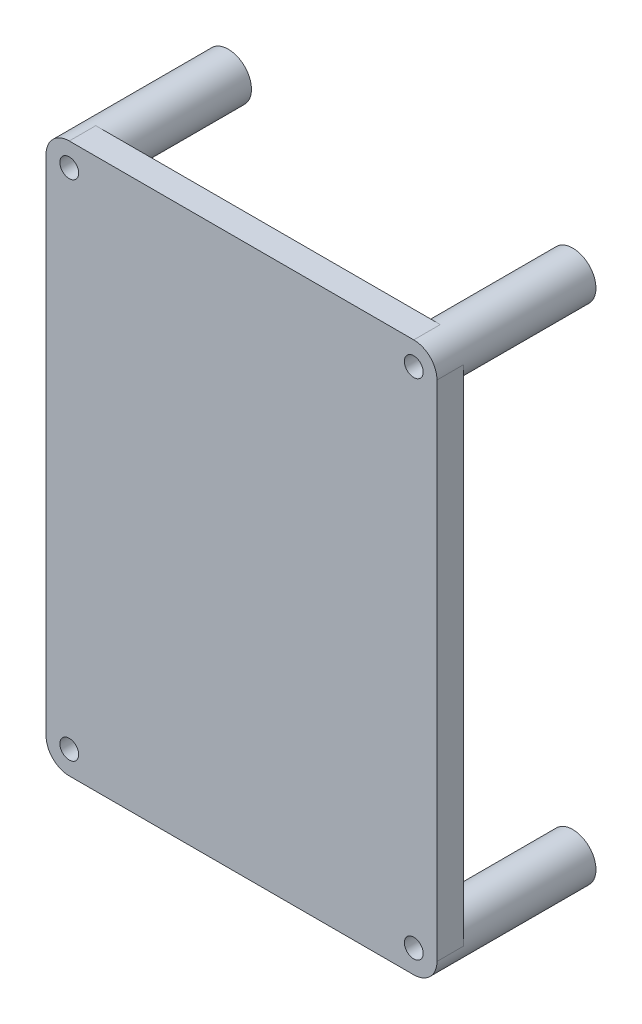
ISO-10303-21;
HEADER;
FILE_DESCRIPTION(('STEP AP214'),'2;1');
FILE_NAME('part.step','',(''),(''),'','','');
FILE_SCHEMA(('AUTOMOTIVE_DESIGN { 1 0 10303 214 1 1 1 1 }'));
ENDSEC;
DATA;
#1=APPLICATION_CONTEXT('core data for automotive mechanical design processes');
#2=APPLICATION_PROTOCOL_DEFINITION('international standard','automotive_design',2000,#1);
#3=PRODUCT_CONTEXT('',#1,'mechanical');
#4=PRODUCT('Part','Part','',(#3));
#5=PRODUCT_RELATED_PRODUCT_CATEGORY('part','',(#4));
#6=PRODUCT_DEFINITION_FORMATION('','',#4);
#7=PRODUCT_DEFINITION_CONTEXT('part definition',#1,'design');
#8=PRODUCT_DEFINITION('design','',#6,#7);
#9=PRODUCT_DEFINITION_SHAPE('','',#8);
#10=(LENGTH_UNIT() NAMED_UNIT(*) SI_UNIT(.MILLI.,.METRE.));
#11=(NAMED_UNIT(*) PLANE_ANGLE_UNIT() SI_UNIT($,.RADIAN.));
#12=(NAMED_UNIT(*) SI_UNIT($,.STERADIAN.) SOLID_ANGLE_UNIT());
#13=UNCERTAINTY_MEASURE_WITH_UNIT(LENGTH_MEASURE(1.E-05),#10,'distance_accuracy_value','');
#14=(GEOMETRIC_REPRESENTATION_CONTEXT(3) GLOBAL_UNCERTAINTY_ASSIGNED_CONTEXT((#13)) GLOBAL_UNIT_ASSIGNED_CONTEXT((#10,
#11,#12)) REPRESENTATION_CONTEXT('',''));
#15=CARTESIAN_POINT('',(0.,0.,0.));
#16=DIRECTION('',(0.,0.,1.));
#17=DIRECTION('',(1.,0.,0.));
#18=AXIS2_PLACEMENT_3D('',#15,#16,#17);
#19=CARTESIAN_POINT('',(160.526557276723,113.230165260636,206.266714262562));
#20=DIRECTION('',(0.,0.,1.));
#21=DIRECTION('',(1.,0.,0.));
#22=AXIS2_PLACEMENT_3D('',#19,#20,#21);
#23=PLANE('',#22);
#24=CARTESIAN_POINT('',(108.526557276723,113.230165260636,206.266714262562));
#25=DIRECTION('',(0.,0.,-1.));
#26=DIRECTION('',(-1.,0.,0.));
#27=AXIS2_PLACEMENT_3D('',#24,#25,#26);
#28=CIRCLE('',#27,3.50000000000001);
#29=CARTESIAN_POINT('',(105.026557276723,113.230165260636,206.266714262562));
#30=VERTEX_POINT('',#29);
#31=CARTESIAN_POINT('',(108.526557276723,109.730165260636,206.266714262562));
#32=VERTEX_POINT('',#31);
#33=EDGE_CURVE('E75',#30,#32,#28,.T.);
#34=ORIENTED_EDGE('',*,*,#33,.F.);
#35=DIRECTION('',(0.,-1.,0.));
#36=VECTOR('',#35,1.);
#37=CARTESIAN_POINT('',(105.026557276723,189.230165260636,206.266714262562));
#38=LINE('',#37,#36);
#39=CARTESIAN_POINT('',(105.026557276723,189.230165260636,206.266714262562));
#40=VERTEX_POINT('',#39);
#41=EDGE_CURVE('E115',#40,#30,#38,.T.);
#42=ORIENTED_EDGE('',*,*,#41,.F.);
#43=CARTESIAN_POINT('',(108.526557276723,189.230165260636,206.266714262562));
#44=DIRECTION('',(0.,0.,-1.));
#45=DIRECTION('',(-1.,0.,0.));
#46=AXIS2_PLACEMENT_3D('',#43,#44,#45);
#47=CIRCLE('',#46,3.50000000000002);
#48=CARTESIAN_POINT('',(108.526557276723,192.730165260636,206.266714262562));
#49=VERTEX_POINT('',#48);
#50=EDGE_CURVE('E11',#49,#40,#47,.T.);
#51=ORIENTED_EDGE('',*,*,#50,.F.);
#52=DIRECTION('',(-1.,0.,0.));
#53=VECTOR('',#52,1.);
#54=CARTESIAN_POINT('',(160.526557276723,192.730165260636,206.266714262562));
#55=LINE('',#54,#53);
#56=CARTESIAN_POINT('',(160.526557276723,192.730165260636,206.266714262562));
#57=VERTEX_POINT('',#56);
#58=EDGE_CURVE('E129',#57,#49,#55,.T.);
#59=ORIENTED_EDGE('',*,*,#58,.F.);
#60=CARTESIAN_POINT('',(160.526557276723,189.230165260636,206.266714262562));
#61=DIRECTION('',(0.,0.,-1.));
#62=DIRECTION('',(-1.,0.,0.));
#63=AXIS2_PLACEMENT_3D('',#60,#61,#62);
#64=CIRCLE('',#63,3.49999999999999);
#65=CARTESIAN_POINT('',(164.026557276723,189.230165260636,206.266714262562));
#66=VERTEX_POINT('',#65);
#67=EDGE_CURVE('E165',#66,#57,#64,.T.);
#68=ORIENTED_EDGE('',*,*,#67,.F.);
#69=DIRECTION('',(0.,1.,0.));
#70=VECTOR('',#69,1.);
#71=CARTESIAN_POINT('',(164.026557276723,113.230165260636,206.266714262562));
#72=LINE('',#71,#70);
#73=CARTESIAN_POINT('',(164.026557276723,113.230165260636,206.266714262562));
#74=VERTEX_POINT('',#73);
#75=EDGE_CURVE('E126',#74,#66,#72,.T.);
#76=ORIENTED_EDGE('',*,*,#75,.F.);
#77=CARTESIAN_POINT('',(160.526557276723,113.230165260636,206.266714262562));
#78=DIRECTION('',(0.,0.,-1.));
#79=DIRECTION('',(-1.,0.,0.));
#80=AXIS2_PLACEMENT_3D('',#77,#78,#79);
#81=CIRCLE('',#80,3.49999999999999);
#82=CARTESIAN_POINT('',(160.526557276723,109.730165260636,206.266714262562));
#83=VERTEX_POINT('',#82);
#84=EDGE_CURVE('E158',#83,#74,#81,.T.);
#85=ORIENTED_EDGE('',*,*,#84,.F.);
#86=DIRECTION('',(1.,0.,0.));
#87=VECTOR('',#86,1.);
#88=CARTESIAN_POINT('',(108.526557276723,109.730165260636,206.266714262562));
#89=LINE('',#88,#87);
#90=EDGE_CURVE('E133',#32,#83,#89,.T.);
#91=ORIENTED_EDGE('',*,*,#90,.F.);
#92=EDGE_LOOP('',(#34,#42,#51,#59,#68,#76,#85,#91));
#93=FACE_BOUND('',#92,.T.);
#94=ADVANCED_FACE('F33',(#93),#23,.F.);
#95=CARTESIAN_POINT('',(160.526557276723,113.230165260636,210.266714262562));
#96=DIRECTION('',(0.,0.,1.));
#97=DIRECTION('',(1.,0.,0.));
#98=AXIS2_PLACEMENT_3D('',#95,#96,#97);
#99=PLANE('',#98);
#100=CARTESIAN_POINT('',(160.526557276723,189.230165260636,210.266714262562));
#101=DIRECTION('',(0.,0.,1.));
#102=DIRECTION('',(1.,0.,0.));
#103=AXIS2_PLACEMENT_3D('',#100,#101,#102);
#104=CIRCLE('',#103,1.42240000000002);
#105=CARTESIAN_POINT('',(161.948957276723,189.230165260636,210.266714262562));
#106=VERTEX_POINT('',#105);
#107=EDGE_CURVE('E184',#106,#106,#104,.T.);
#108=ORIENTED_EDGE('',*,*,#107,.F.);
#109=EDGE_LOOP('',(#108));
#110=FACE_BOUND('',#109,.T.);
#111=CARTESIAN_POINT('',(160.526557276723,113.230165260636,210.266714262562));
#112=DIRECTION('',(0.,0.,1.));
#113=DIRECTION('',(1.,0.,0.));
#114=AXIS2_PLACEMENT_3D('',#111,#112,#113);
#115=CIRCLE('',#114,1.42240000000002);
#116=CARTESIAN_POINT('',(161.948957276723,113.230165260636,210.266714262562));
#117=VERTEX_POINT('',#116);
#118=EDGE_CURVE('E130',#117,#117,#115,.T.);
#119=ORIENTED_EDGE('',*,*,#118,.F.);
#120=EDGE_LOOP('',(#119));
#121=FACE_BOUND('',#120,.T.);
#122=CARTESIAN_POINT('',(160.526557276723,113.230165260636,210.266714262562));
#123=DIRECTION('',(0.,0.,1.));
#124=DIRECTION('',(1.,0.,0.));
#125=AXIS2_PLACEMENT_3D('',#122,#123,#124);
#126=CIRCLE('',#125,3.50000000000002);
#127=CARTESIAN_POINT('',(160.526557276723,109.730165260636,210.266714262562));
#128=VERTEX_POINT('',#127);
#129=CARTESIAN_POINT('',(164.026557276723,113.230165260636,210.266714262562));
#130=VERTEX_POINT('',#129);
#131=EDGE_CURVE('E136',#128,#130,#126,.T.);
#132=ORIENTED_EDGE('',*,*,#131,.T.);
#133=DIRECTION('',(0.,1.,0.));
#134=VECTOR('',#133,1.);
#135=CARTESIAN_POINT('',(164.026557276723,113.230165260636,210.266714262562));
#136=LINE('',#135,#134);
#137=CARTESIAN_POINT('',(164.026557276723,189.230165260636,210.266714262562));
#138=VERTEX_POINT('',#137);
#139=EDGE_CURVE('E84',#130,#138,#136,.T.);
#140=ORIENTED_EDGE('',*,*,#139,.T.);
#141=CARTESIAN_POINT('',(160.526557276723,189.230165260636,210.266714262562));
#142=DIRECTION('',(0.,0.,1.));
#143=DIRECTION('',(1.,0.,0.));
#144=AXIS2_PLACEMENT_3D('',#141,#142,#143);
#145=CIRCLE('',#144,3.49999999999999);
#146=CARTESIAN_POINT('',(160.526557276723,192.730165260636,210.266714262562));
#147=VERTEX_POINT('',#146);
#148=EDGE_CURVE('E194',#138,#147,#145,.T.);
#149=ORIENTED_EDGE('',*,*,#148,.T.);
#150=DIRECTION('',(-1.,0.,0.));
#151=VECTOR('',#150,1.);
#152=CARTESIAN_POINT('',(160.526557276723,192.730165260636,210.266714262562));
#153=LINE('',#152,#151);
#154=CARTESIAN_POINT('',(108.526557276723,192.730165260636,210.266714262562));
#155=VERTEX_POINT('',#154);
#156=EDGE_CURVE('E196',#147,#155,#153,.T.);
#157=ORIENTED_EDGE('',*,*,#156,.T.);
#158=CARTESIAN_POINT('',(108.526557276723,189.230165260636,210.266714262562));
#159=DIRECTION('',(0.,0.,1.));
#160=DIRECTION('',(1.,0.,0.));
#161=AXIS2_PLACEMENT_3D('',#158,#159,#160);
#162=CIRCLE('',#161,3.49999999999999);
#163=CARTESIAN_POINT('',(105.026557276723,189.230165260636,210.266714262562));
#164=VERTEX_POINT('',#163);
#165=EDGE_CURVE('E106',#155,#164,#162,.T.);
#166=ORIENTED_EDGE('',*,*,#165,.T.);
#167=DIRECTION('',(0.,-1.,0.));
#168=VECTOR('',#167,1.);
#169=CARTESIAN_POINT('',(105.026557276723,189.230165260636,210.266714262562));
#170=LINE('',#169,#168);
#171=CARTESIAN_POINT('',(105.026557276723,113.230165260636,210.266714262562));
#172=VERTEX_POINT('',#171);
#173=EDGE_CURVE('E99',#164,#172,#170,.T.);
#174=ORIENTED_EDGE('',*,*,#173,.T.);
#175=CARTESIAN_POINT('',(108.526557276723,113.230165260636,210.266714262562));
#176=DIRECTION('',(0.,0.,1.));
#177=DIRECTION('',(1.,0.,0.));
#178=AXIS2_PLACEMENT_3D('',#175,#176,#177);
#179=CIRCLE('',#178,3.50000000000002);
#180=CARTESIAN_POINT('',(108.526557276723,109.730165260636,210.266714262562));
#181=VERTEX_POINT('',#180);
#182=EDGE_CURVE('E104',#172,#181,#179,.T.);
#183=ORIENTED_EDGE('',*,*,#182,.T.);
#184=DIRECTION('',(1.,0.,0.));
#185=VECTOR('',#184,1.);
#186=CARTESIAN_POINT('',(108.526557276723,109.730165260636,210.266714262562));
#187=LINE('',#186,#185);
#188=EDGE_CURVE('E51',#181,#128,#187,.T.);
#189=ORIENTED_EDGE('',*,*,#188,.T.);
#190=EDGE_LOOP('',(#132,#140,#149,#157,#166,#174,#183,#189));
#191=FACE_BOUND('',#190,.T.);
#192=CARTESIAN_POINT('',(108.526557276723,113.230165260636,210.266714262562));
#193=DIRECTION('',(0.,0.,1.));
#194=DIRECTION('',(1.,0.,0.));
#195=AXIS2_PLACEMENT_3D('',#192,#193,#194);
#196=CIRCLE('',#195,1.42239999999998);
#197=CARTESIAN_POINT('',(109.948957276723,113.230165260636,210.266714262562));
#198=VERTEX_POINT('',#197);
#199=EDGE_CURVE('E187',#198,#198,#196,.T.);
#200=ORIENTED_EDGE('',*,*,#199,.F.);
#201=EDGE_LOOP('',(#200));
#202=FACE_BOUND('',#201,.T.);
#203=CARTESIAN_POINT('',(108.526557276723,189.230165260636,210.266714262562));
#204=DIRECTION('',(0.,0.,1.));
#205=DIRECTION('',(1.,0.,0.));
#206=AXIS2_PLACEMENT_3D('',#203,#204,#205);
#207=CIRCLE('',#206,1.42240000000001);
#208=CARTESIAN_POINT('',(109.948957276723,189.230165260636,210.266714262562));
#209=VERTEX_POINT('',#208);
#210=EDGE_CURVE('E180',#209,#209,#207,.T.);
#211=ORIENTED_EDGE('',*,*,#210,.F.);
#212=EDGE_LOOP('',(#211));
#213=FACE_BOUND('',#212,.T.);
#214=ADVANCED_FACE('F101',(#110,#121,#191,#202,#213),#99,.T.);
#215=CARTESIAN_POINT('',(160.526557276723,113.230165260636,210.266714262562));
#216=DIRECTION('',(0.,0.,-1.));
#217=DIRECTION('',(-1.,0.,0.));
#218=AXIS2_PLACEMENT_3D('',#215,#216,#217);
#219=CYLINDRICAL_SURFACE('',#218,3.50000000000002);
#220=DIRECTION('',(0.,0.,-1.));
#221=VECTOR('',#220,1.);
#222=CARTESIAN_POINT('',(160.526557276723,109.730165260636,210.266714262562));
#223=LINE('',#222,#221);
#224=EDGE_CURVE('E122',#128,#83,#223,.T.);
#225=ORIENTED_EDGE('',*,*,#224,.T.);
#226=ORIENTED_EDGE('',*,*,#84,.T.);
#227=DIRECTION('',(0.,0.,-1.));
#228=VECTOR('',#227,1.);
#229=CARTESIAN_POINT('',(164.026557276723,113.230165260636,210.266714262562));
#230=LINE('',#229,#228);
#231=EDGE_CURVE('E37',#130,#74,#230,.T.);
#232=ORIENTED_EDGE('',*,*,#231,.F.);
#233=ORIENTED_EDGE('',*,*,#131,.F.);
#234=EDGE_LOOP('',(#225,#226,#232,#233));
#235=FACE_BOUND('',#234,.T.);
#236=CARTESIAN_POINT('',(160.526557276723,113.230165260636,186.266714262562));
#237=DIRECTION('',(0.,0.,-1.));
#238=DIRECTION('',(-1.,0.,0.));
#239=AXIS2_PLACEMENT_3D('',#236,#237,#238);
#240=CIRCLE('',#239,3.49999999999999);
#241=CARTESIAN_POINT('',(157.026557276723,113.230165260636,186.266714262562));
#242=VERTEX_POINT('',#241);
#243=EDGE_CURVE('E161',#242,#242,#240,.T.);
#244=ORIENTED_EDGE('',*,*,#243,.F.);
#245=EDGE_LOOP('',(#244));
#246=FACE_BOUND('',#245,.T.);
#247=ADVANCED_FACE('F35',(#235,#246),#219,.T.);
#248=CARTESIAN_POINT('',(164.026557276723,113.230165260636,210.266714262562));
#249=DIRECTION('',(-1.,0.,0.));
#250=DIRECTION('',(0.,-1.,0.));
#251=AXIS2_PLACEMENT_3D('',#248,#249,#250);
#252=PLANE('',#251);
#253=ORIENTED_EDGE('',*,*,#75,.T.);
#254=DIRECTION('',(0.,0.,-1.));
#255=VECTOR('',#254,1.);
#256=CARTESIAN_POINT('',(164.026557276723,189.230165260636,210.266714262562));
#257=LINE('',#256,#255);
#258=EDGE_CURVE('E146',#138,#66,#257,.T.);
#259=ORIENTED_EDGE('',*,*,#258,.F.);
#260=ORIENTED_EDGE('',*,*,#139,.F.);
#261=ORIENTED_EDGE('',*,*,#231,.T.);
#262=EDGE_LOOP('',(#253,#259,#260,#261));
#263=FACE_BOUND('',#262,.T.);
#264=ADVANCED_FACE('F152',(#263),#252,.F.);
#265=CARTESIAN_POINT('',(160.526557276723,189.230165260636,210.266714262562));
#266=DIRECTION('',(0.,0.,-1.));
#267=DIRECTION('',(-1.,0.,0.));
#268=AXIS2_PLACEMENT_3D('',#265,#266,#267);
#269=CYLINDRICAL_SURFACE('',#268,3.49999999999999);
#270=ORIENTED_EDGE('',*,*,#258,.T.);
#271=ORIENTED_EDGE('',*,*,#67,.T.);
#272=DIRECTION('',(0.,0.,-1.));
#273=VECTOR('',#272,1.);
#274=CARTESIAN_POINT('',(160.526557276723,192.730165260636,210.266714262562));
#275=LINE('',#274,#273);
#276=EDGE_CURVE('E144',#147,#57,#275,.T.);
#277=ORIENTED_EDGE('',*,*,#276,.F.);
#278=ORIENTED_EDGE('',*,*,#148,.F.);
#279=EDGE_LOOP('',(#270,#271,#277,#278));
#280=FACE_BOUND('',#279,.T.);
#281=CARTESIAN_POINT('',(160.526557276723,189.230165260636,186.266714262562));
#282=DIRECTION('',(0.,0.,-1.));
#283=DIRECTION('',(-1.,0.,0.));
#284=AXIS2_PLACEMENT_3D('',#281,#282,#283);
#285=CIRCLE('',#284,3.49999999999999);
#286=CARTESIAN_POINT('',(157.026557276723,189.230165260636,186.266714262562));
#287=VERTEX_POINT('',#286);
#288=EDGE_CURVE('E167',#287,#287,#285,.T.);
#289=ORIENTED_EDGE('',*,*,#288,.F.);
#290=EDGE_LOOP('',(#289));
#291=FACE_BOUND('',#290,.T.);
#292=ADVANCED_FACE('F225',(#280,#291),#269,.T.);
#293=CARTESIAN_POINT('',(160.526557276723,192.730165260636,210.266714262562));
#294=DIRECTION('',(0.,-1.,0.));
#295=DIRECTION('',(0.,0.,-1.));
#296=AXIS2_PLACEMENT_3D('',#293,#294,#295);
#297=PLANE('',#296);
#298=ORIENTED_EDGE('',*,*,#58,.T.);
#299=DIRECTION('',(0.,0.,-1.));
#300=VECTOR('',#299,1.);
#301=CARTESIAN_POINT('',(108.526557276723,192.730165260636,210.266714262562));
#302=LINE('',#301,#300);
#303=EDGE_CURVE('E141',#155,#49,#302,.T.);
#304=ORIENTED_EDGE('',*,*,#303,.F.);
#305=ORIENTED_EDGE('',*,*,#156,.F.);
#306=ORIENTED_EDGE('',*,*,#276,.T.);
#307=EDGE_LOOP('',(#298,#304,#305,#306));
#308=FACE_BOUND('',#307,.T.);
#309=ADVANCED_FACE('F200',(#308),#297,.F.);
#310=CARTESIAN_POINT('',(108.526557276723,189.230165260636,210.266714262562));
#311=DIRECTION('',(0.,0.,-1.));
#312=DIRECTION('',(-1.,0.,0.));
#313=AXIS2_PLACEMENT_3D('',#310,#311,#312);
#314=CYLINDRICAL_SURFACE('',#313,3.49999999999999);
#315=ORIENTED_EDGE('',*,*,#303,.T.);
#316=ORIENTED_EDGE('',*,*,#50,.T.);
#317=DIRECTION('',(0.,0.,-1.));
#318=VECTOR('',#317,1.);
#319=CARTESIAN_POINT('',(105.026557276723,189.230165260636,210.266714262562));
#320=LINE('',#319,#318);
#321=EDGE_CURVE('E116',#164,#40,#320,.T.);
#322=ORIENTED_EDGE('',*,*,#321,.F.);
#323=ORIENTED_EDGE('',*,*,#165,.F.);
#324=EDGE_LOOP('',(#315,#316,#322,#323));
#325=FACE_BOUND('',#324,.T.);
#326=CARTESIAN_POINT('',(108.526557276723,189.230165260636,186.266714262562));
#327=DIRECTION('',(0.,0.,-1.));
#328=DIRECTION('',(-1.,0.,0.));
#329=AXIS2_PLACEMENT_3D('',#326,#327,#328);
#330=CIRCLE('',#329,3.50000000000002);
#331=CARTESIAN_POINT('',(105.026557276723,189.230165260636,186.266714262562));
#332=VERTEX_POINT('',#331);
#333=EDGE_CURVE('E178',#332,#332,#330,.T.);
#334=ORIENTED_EDGE('',*,*,#333,.F.);
#335=EDGE_LOOP('',(#334));
#336=FACE_BOUND('',#335,.T.);
#337=ADVANCED_FACE('F202',(#325,#336),#314,.T.);
#338=CARTESIAN_POINT('',(105.026557276723,189.230165260636,210.266714262562));
#339=DIRECTION('',(1.,0.,0.));
#340=DIRECTION('',(0.,1.,0.));
#341=AXIS2_PLACEMENT_3D('',#338,#339,#340);
#342=PLANE('',#341);
#343=ORIENTED_EDGE('',*,*,#41,.T.);
#344=DIRECTION('',(0.,0.,-1.));
#345=VECTOR('',#344,1.);
#346=CARTESIAN_POINT('',(105.026557276723,113.230165260636,210.266714262562));
#347=LINE('',#346,#345);
#348=EDGE_CURVE('E112',#172,#30,#347,.T.);
#349=ORIENTED_EDGE('',*,*,#348,.F.);
#350=ORIENTED_EDGE('',*,*,#173,.F.);
#351=ORIENTED_EDGE('',*,*,#321,.T.);
#352=EDGE_LOOP('',(#343,#349,#350,#351));
#353=FACE_BOUND('',#352,.T.);
#354=ADVANCED_FACE('F113',(#353),#342,.F.);
#355=CARTESIAN_POINT('',(108.526557276723,113.230165260636,210.266714262562));
#356=DIRECTION('',(0.,0.,-1.));
#357=DIRECTION('',(-1.,0.,0.));
#358=AXIS2_PLACEMENT_3D('',#355,#356,#357);
#359=CYLINDRICAL_SURFACE('',#358,3.50000000000002);
#360=ORIENTED_EDGE('',*,*,#348,.T.);
#361=ORIENTED_EDGE('',*,*,#33,.T.);
#362=DIRECTION('',(0.,0.,-1.));
#363=VECTOR('',#362,1.);
#364=CARTESIAN_POINT('',(108.526557276723,109.730165260636,210.266714262562));
#365=LINE('',#364,#363);
#366=EDGE_CURVE('E117',#181,#32,#365,.T.);
#367=ORIENTED_EDGE('',*,*,#366,.F.);
#368=ORIENTED_EDGE('',*,*,#182,.F.);
#369=EDGE_LOOP('',(#360,#361,#367,#368));
#370=FACE_BOUND('',#369,.T.);
#371=CARTESIAN_POINT('',(108.526557276723,113.230165260636,186.266714262562));
#372=DIRECTION('',(0.,0.,-1.));
#373=DIRECTION('',(-1.,0.,0.));
#374=AXIS2_PLACEMENT_3D('',#371,#372,#373);
#375=CIRCLE('',#374,3.50000000000001);
#376=CARTESIAN_POINT('',(105.026557276723,113.230165260636,186.266714262562));
#377=VERTEX_POINT('',#376);
#378=EDGE_CURVE('E205',#377,#377,#375,.T.);
#379=ORIENTED_EDGE('',*,*,#378,.F.);
#380=EDGE_LOOP('',(#379));
#381=FACE_BOUND('',#380,.T.);
#382=ADVANCED_FACE('F119',(#370,#381),#359,.T.);
#383=CARTESIAN_POINT('',(108.526557276723,109.730165260636,210.266714262562));
#384=DIRECTION('',(0.,1.,0.));
#385=DIRECTION('',(-1.,0.,0.));
#386=AXIS2_PLACEMENT_3D('',#383,#384,#385);
#387=PLANE('',#386);
#388=ORIENTED_EDGE('',*,*,#90,.T.);
#389=ORIENTED_EDGE('',*,*,#224,.F.);
#390=ORIENTED_EDGE('',*,*,#188,.F.);
#391=ORIENTED_EDGE('',*,*,#366,.T.);
#392=EDGE_LOOP('',(#388,#389,#390,#391));
#393=FACE_BOUND('',#392,.T.);
#394=ADVANCED_FACE('F234',(#393),#387,.F.);
#395=CARTESIAN_POINT('',(160.526557276723,113.230165260636,210.266714262562));
#396=DIRECTION('',(0.,0.,-1.));
#397=DIRECTION('',(-1.,0.,0.));
#398=AXIS2_PLACEMENT_3D('',#395,#396,#397);
#399=CYLINDRICAL_SURFACE('',#398,1.42240000000002);
#400=ORIENTED_EDGE('',*,*,#118,.T.);
#401=EDGE_LOOP('',(#400));
#402=FACE_BOUND('',#401,.T.);
#403=CARTESIAN_POINT('',(160.526557276723,113.230165260636,186.266714262562));
#404=DIRECTION('',(0.,0.,-1.));
#405=DIRECTION('',(-1.,0.,0.));
#406=AXIS2_PLACEMENT_3D('',#403,#404,#405);
#407=CIRCLE('',#406,1.4224);
#408=CARTESIAN_POINT('',(159.104157276723,113.230165260636,186.266714262562));
#409=VERTEX_POINT('',#408);
#410=EDGE_CURVE('E162',#409,#409,#407,.T.);
#411=ORIENTED_EDGE('',*,*,#410,.T.);
#412=EDGE_LOOP('',(#411));
#413=FACE_BOUND('',#412,.T.);
#414=ADVANCED_FACE('F237',(#402,#413),#399,.F.);
#415=CARTESIAN_POINT('',(108.526557276723,113.230165260636,210.266714262562));
#416=DIRECTION('',(0.,0.,-1.));
#417=DIRECTION('',(-1.,0.,0.));
#418=AXIS2_PLACEMENT_3D('',#415,#416,#417);
#419=CYLINDRICAL_SURFACE('',#418,1.42239999999998);
#420=ORIENTED_EDGE('',*,*,#199,.T.);
#421=EDGE_LOOP('',(#420));
#422=FACE_BOUND('',#421,.T.);
#423=CARTESIAN_POINT('',(108.526557276723,113.230165260636,186.266714262562));
#424=DIRECTION('',(0.,0.,-1.));
#425=DIRECTION('',(-1.,0.,0.));
#426=AXIS2_PLACEMENT_3D('',#423,#424,#425);
#427=CIRCLE('',#426,1.42239999999996);
#428=CARTESIAN_POINT('',(107.104157276723,113.230165260636,186.266714262562));
#429=VERTEX_POINT('',#428);
#430=EDGE_CURVE('E206',#429,#429,#427,.T.);
#431=ORIENTED_EDGE('',*,*,#430,.T.);
#432=EDGE_LOOP('',(#431));
#433=FACE_BOUND('',#432,.T.);
#434=ADVANCED_FACE('F263',(#422,#433),#419,.F.);
#435=CARTESIAN_POINT('',(160.526557276723,189.230165260636,210.266714262562));
#436=DIRECTION('',(0.,0.,-1.));
#437=DIRECTION('',(-1.,0.,0.));
#438=AXIS2_PLACEMENT_3D('',#435,#436,#437);
#439=CYLINDRICAL_SURFACE('',#438,1.42240000000002);
#440=ORIENTED_EDGE('',*,*,#107,.T.);
#441=EDGE_LOOP('',(#440));
#442=FACE_BOUND('',#441,.T.);
#443=CARTESIAN_POINT('',(160.526557276723,189.230165260636,186.266714262562));
#444=DIRECTION('',(0.,0.,-1.));
#445=DIRECTION('',(-1.,0.,0.));
#446=AXIS2_PLACEMENT_3D('',#443,#444,#445);
#447=CIRCLE('',#446,1.42240000000002);
#448=CARTESIAN_POINT('',(159.104157276723,189.230165260636,186.266714262562));
#449=VERTEX_POINT('',#448);
#450=EDGE_CURVE('E168',#449,#449,#447,.T.);
#451=ORIENTED_EDGE('',*,*,#450,.T.);
#452=EDGE_LOOP('',(#451));
#453=FACE_BOUND('',#452,.T.);
#454=ADVANCED_FACE('F260',(#442,#453),#439,.F.);
#455=CARTESIAN_POINT('',(108.526557276723,189.230165260636,210.266714262562));
#456=DIRECTION('',(0.,0.,-1.));
#457=DIRECTION('',(-1.,0.,0.));
#458=AXIS2_PLACEMENT_3D('',#455,#456,#457);
#459=CYLINDRICAL_SURFACE('',#458,1.42240000000001);
#460=ORIENTED_EDGE('',*,*,#210,.T.);
#461=EDGE_LOOP('',(#460));
#462=FACE_BOUND('',#461,.T.);
#463=CARTESIAN_POINT('',(108.526557276723,189.230165260636,186.266714262562));
#464=DIRECTION('',(0.,0.,-1.));
#465=DIRECTION('',(-1.,0.,0.));
#466=AXIS2_PLACEMENT_3D('',#463,#464,#465);
#467=CIRCLE('',#466,1.42240000000001);
#468=CARTESIAN_POINT('',(107.104157276723,189.230165260636,186.266714262562));
#469=VERTEX_POINT('',#468);
#470=EDGE_CURVE('E171',#469,#469,#467,.T.);
#471=ORIENTED_EDGE('',*,*,#470,.T.);
#472=EDGE_LOOP('',(#471));
#473=FACE_BOUND('',#472,.T.);
#474=ADVANCED_FACE('F262',(#462,#473),#459,.F.);
#475=CARTESIAN_POINT('',(108.526557276723,189.230165260636,186.266714262562));
#476=DIRECTION('',(0.,0.,-1.));
#477=DIRECTION('',(-1.,0.,0.));
#478=AXIS2_PLACEMENT_3D('',#475,#476,#477);
#479=PLANE('',#478);
#480=ORIENTED_EDGE('',*,*,#333,.T.);
#481=EDGE_LOOP('',(#480));
#482=FACE_BOUND('',#481,.T.);
#483=ORIENTED_EDGE('',*,*,#470,.F.);
#484=EDGE_LOOP('',(#483));
#485=FACE_BOUND('',#484,.T.);
#486=ADVANCED_FACE('F256',(#482,#485),#479,.T.);
#487=CARTESIAN_POINT('',(160.526557276723,189.230165260636,186.266714262562));
#488=DIRECTION('',(0.,0.,-1.));
#489=DIRECTION('',(-1.,0.,0.));
#490=AXIS2_PLACEMENT_3D('',#487,#488,#489);
#491=PLANE('',#490);
#492=ORIENTED_EDGE('',*,*,#288,.T.);
#493=EDGE_LOOP('',(#492));
#494=FACE_BOUND('',#493,.T.);
#495=ORIENTED_EDGE('',*,*,#450,.F.);
#496=EDGE_LOOP('',(#495));
#497=FACE_BOUND('',#496,.T.);
#498=ADVANCED_FACE('F253',(#494,#497),#491,.T.);
#499=CARTESIAN_POINT('',(160.526557276723,113.230165260636,186.266714262562));
#500=DIRECTION('',(0.,0.,-1.));
#501=DIRECTION('',(-1.,0.,0.));
#502=AXIS2_PLACEMENT_3D('',#499,#500,#501);
#503=PLANE('',#502);
#504=ORIENTED_EDGE('',*,*,#243,.T.);
#505=EDGE_LOOP('',(#504));
#506=FACE_BOUND('',#505,.T.);
#507=ORIENTED_EDGE('',*,*,#410,.F.);
#508=EDGE_LOOP('',(#507));
#509=FACE_BOUND('',#508,.T.);
#510=ADVANCED_FACE('F218',(#506,#509),#503,.T.);
#511=CARTESIAN_POINT('',(108.526557276723,113.230165260636,186.266714262562));
#512=DIRECTION('',(0.,0.,-1.));
#513=DIRECTION('',(-1.,0.,0.));
#514=AXIS2_PLACEMENT_3D('',#511,#512,#513);
#515=PLANE('',#514);
#516=ORIENTED_EDGE('',*,*,#378,.T.);
#517=EDGE_LOOP('',(#516));
#518=FACE_BOUND('',#517,.T.);
#519=ORIENTED_EDGE('',*,*,#430,.F.);
#520=EDGE_LOOP('',(#519));
#521=FACE_BOUND('',#520,.T.);
#522=ADVANCED_FACE('F283',(#518,#521),#515,.T.);
#523=CLOSED_SHELL('',(#94,#214,#247,#264,#292,#309,#337,#354,#382,#394,#414,#434,#454,#474,#486,
#498,#510,#522));
#524=MANIFOLD_SOLID_BREP('B2',#523);
#525=ADVANCED_BREP_SHAPE_REPRESENTATION('',(#18,#524),#14);
#526=SHAPE_DEFINITION_REPRESENTATION(#9,#525);
ENDSEC;
END-ISO-10303-21;
